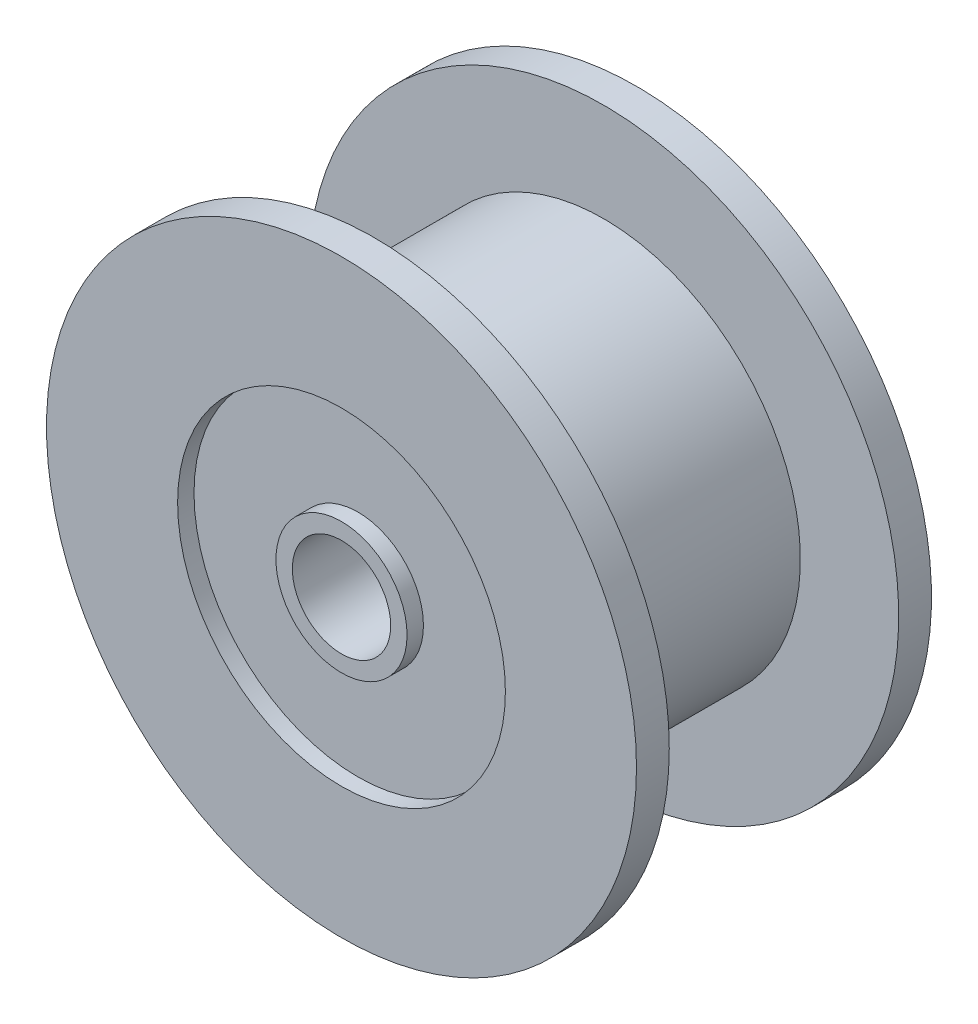
ISO-10303-21;
HEADER;
FILE_DESCRIPTION(('STEP AP214'),'2;1');
FILE_NAME('part.step','',(''),(''),'','','');
FILE_SCHEMA(('AUTOMOTIVE_DESIGN { 1 0 10303 214 1 1 1 1 }'));
ENDSEC;
DATA;
#1=APPLICATION_CONTEXT('core data for automotive mechanical design processes');
#2=APPLICATION_PROTOCOL_DEFINITION('international standard','automotive_design',2000,#1);
#3=PRODUCT_CONTEXT('',#1,'mechanical');
#4=PRODUCT('Part','Part','',(#3));
#5=PRODUCT_RELATED_PRODUCT_CATEGORY('part','',(#4));
#6=PRODUCT_DEFINITION_FORMATION('','',#4);
#7=PRODUCT_DEFINITION_CONTEXT('part definition',#1,'design');
#8=PRODUCT_DEFINITION('design','',#6,#7);
#9=PRODUCT_DEFINITION_SHAPE('','',#8);
#10=(LENGTH_UNIT() NAMED_UNIT(*) SI_UNIT(.MILLI.,.METRE.));
#11=(NAMED_UNIT(*) PLANE_ANGLE_UNIT() SI_UNIT($,.RADIAN.));
#12=(NAMED_UNIT(*) SI_UNIT($,.STERADIAN.) SOLID_ANGLE_UNIT());
#13=UNCERTAINTY_MEASURE_WITH_UNIT(LENGTH_MEASURE(1.E-05),#10,'distance_accuracy_value','');
#14=(GEOMETRIC_REPRESENTATION_CONTEXT(3) GLOBAL_UNCERTAINTY_ASSIGNED_CONTEXT((#13)) GLOBAL_UNIT_ASSIGNED_CONTEXT((#10,
#11,#12)) REPRESENTATION_CONTEXT('',''));
#15=CARTESIAN_POINT('',(0.,0.,0.));
#16=DIRECTION('',(0.,0.,1.));
#17=DIRECTION('',(1.,0.,0.));
#18=AXIS2_PLACEMENT_3D('',#15,#16,#17);
#19=CARTESIAN_POINT('',(0.,0.,8.));
#20=DIRECTION('',(0.,0.,1.));
#21=DIRECTION('',(1.,0.,0.));
#22=AXIS2_PLACEMENT_3D('',#19,#20,#21);
#23=PLANE('',#22);
#24=CARTESIAN_POINT('',(0.,0.,8.));
#25=DIRECTION('',(0.,0.,1.));
#26=DIRECTION('',(1.,0.,0.));
#27=AXIS2_PLACEMENT_3D('',#24,#25,#26);
#28=CIRCLE('',#27,1.5);
#29=CARTESIAN_POINT('',(1.5,0.,8.));
#30=VERTEX_POINT('',#29);
#31=EDGE_CURVE('E61',#30,#30,#28,.T.);
#32=ORIENTED_EDGE('',*,*,#31,.F.);
#33=EDGE_LOOP('',(#32));
#34=FACE_BOUND('',#33,.T.);
#35=CARTESIAN_POINT('',(0.,0.,8.));
#36=DIRECTION('',(0.,0.,1.));
#37=DIRECTION('',(1.,0.,0.));
#38=AXIS2_PLACEMENT_3D('',#35,#36,#37);
#39=CIRCLE('',#38,2.);
#40=CARTESIAN_POINT('',(2.,0.,8.));
#41=VERTEX_POINT('',#40);
#42=EDGE_CURVE('E83',#41,#41,#39,.T.);
#43=ORIENTED_EDGE('',*,*,#42,.T.);
#44=EDGE_LOOP('',(#43));
#45=FACE_BOUND('',#44,.T.);
#46=ADVANCED_FACE('F35',(#34,#45),#23,.T.);
#47=CARTESIAN_POINT('',(0.,0.,-1.));
#48=DIRECTION('',(0.,0.,-1.));
#49=DIRECTION('',(-1.,0.,0.));
#50=AXIS2_PLACEMENT_3D('',#47,#48,#49);
#51=PLANE('',#50);
#52=CARTESIAN_POINT('',(0.,0.,-1.));
#53=DIRECTION('',(0.,0.,-1.));
#54=DIRECTION('',(-1.,0.,0.));
#55=AXIS2_PLACEMENT_3D('',#52,#53,#54);
#56=CIRCLE('',#55,1.5);
#57=CARTESIAN_POINT('',(-1.5,0.,-1.));
#58=VERTEX_POINT('',#57);
#59=EDGE_CURVE('E39',#58,#58,#56,.T.);
#60=ORIENTED_EDGE('',*,*,#59,.F.);
#61=EDGE_LOOP('',(#60));
#62=FACE_BOUND('',#61,.T.);
#63=CARTESIAN_POINT('',(0.,0.,-1.));
#64=DIRECTION('',(0.,0.,-1.));
#65=DIRECTION('',(-1.,0.,0.));
#66=AXIS2_PLACEMENT_3D('',#63,#64,#65);
#67=CIRCLE('',#66,2.);
#68=CARTESIAN_POINT('',(-2.,0.,-1.));
#69=VERTEX_POINT('',#68);
#70=EDGE_CURVE('E71',#69,#69,#67,.T.);
#71=ORIENTED_EDGE('',*,*,#70,.T.);
#72=EDGE_LOOP('',(#71));
#73=FACE_BOUND('',#72,.T.);
#74=ADVANCED_FACE('F123',(#62,#73),#51,.T.);
#75=CARTESIAN_POINT('',(0.,0.,7.));
#76=DIRECTION('',(0.,0.,-1.));
#77=DIRECTION('',(-1.,0.,0.));
#78=AXIS2_PLACEMENT_3D('',#75,#76,#77);
#79=CYLINDRICAL_SURFACE('',#78,6.);
#80=CARTESIAN_POINT('',(0.,0.,7.));
#81=DIRECTION('',(0.,0.,1.));
#82=DIRECTION('',(1.,0.,0.));
#83=AXIS2_PLACEMENT_3D('',#80,#81,#82);
#84=CIRCLE('',#83,6.);
#85=CARTESIAN_POINT('',(6.,0.,7.));
#86=VERTEX_POINT('',#85);
#87=EDGE_CURVE('E10',#86,#86,#84,.T.);
#88=ORIENTED_EDGE('',*,*,#87,.F.);
#89=EDGE_LOOP('',(#88));
#90=FACE_BOUND('',#89,.T.);
#91=CARTESIAN_POINT('',(0.,0.,0.));
#92=DIRECTION('',(0.,0.,-1.));
#93=DIRECTION('',(-1.,0.,0.));
#94=AXIS2_PLACEMENT_3D('',#91,#92,#93);
#95=CIRCLE('',#94,6.);
#96=CARTESIAN_POINT('',(-6.,0.,0.));
#97=VERTEX_POINT('',#96);
#98=EDGE_CURVE('E51',#97,#97,#95,.T.);
#99=ORIENTED_EDGE('',*,*,#98,.F.);
#100=EDGE_LOOP('',(#99));
#101=FACE_BOUND('',#100,.T.);
#102=ADVANCED_FACE('F37',(#90,#101),#79,.T.);
#103=CARTESIAN_POINT('',(0.,0.,7.));
#104=DIRECTION('',(0.,0.,1.));
#105=DIRECTION('',(1.,0.,0.));
#106=AXIS2_PLACEMENT_3D('',#103,#104,#105);
#107=PLANE('',#106);
#108=CARTESIAN_POINT('',(0.,0.,7.));
#109=DIRECTION('',(0.,0.,1.));
#110=DIRECTION('',(1.,0.,0.));
#111=AXIS2_PLACEMENT_3D('',#108,#109,#110);
#112=CIRCLE('',#111,9.);
#113=CARTESIAN_POINT('',(9.,0.,7.));
#114=VERTEX_POINT('',#113);
#115=EDGE_CURVE('E47',#114,#114,#112,.T.);
#116=ORIENTED_EDGE('',*,*,#115,.F.);
#117=EDGE_LOOP('',(#116));
#118=FACE_BOUND('',#117,.T.);
#119=ORIENTED_EDGE('',*,*,#87,.T.);
#120=EDGE_LOOP('',(#119));
#121=FACE_BOUND('',#120,.T.);
#122=ADVANCED_FACE('F115',(#118,#121),#107,.F.);
#123=CARTESIAN_POINT('',(0.,0.,8.));
#124=DIRECTION('',(0.,0.,-1.));
#125=DIRECTION('',(-1.,0.,0.));
#126=AXIS2_PLACEMENT_3D('',#123,#124,#125);
#127=CYLINDRICAL_SURFACE('',#126,9.);
#128=CARTESIAN_POINT('',(0.,0.,8.));
#129=DIRECTION('',(0.,0.,1.));
#130=DIRECTION('',(1.,0.,0.));
#131=AXIS2_PLACEMENT_3D('',#128,#129,#130);
#132=CIRCLE('',#131,9.);
#133=CARTESIAN_POINT('',(9.,0.,8.));
#134=VERTEX_POINT('',#133);
#135=EDGE_CURVE('E43',#134,#134,#132,.T.);
#136=ORIENTED_EDGE('',*,*,#135,.F.);
#137=EDGE_LOOP('',(#136));
#138=FACE_BOUND('',#137,.T.);
#139=ORIENTED_EDGE('',*,*,#115,.T.);
#140=EDGE_LOOP('',(#139));
#141=FACE_BOUND('',#140,.T.);
#142=ADVANCED_FACE('F109',(#138,#141),#127,.T.);
#143=CARTESIAN_POINT('',(0.,0.,8.));
#144=DIRECTION('',(0.,0.,1.));
#145=DIRECTION('',(1.,0.,0.));
#146=AXIS2_PLACEMENT_3D('',#143,#144,#145);
#147=CIRCLE('',#146,5.);
#148=CARTESIAN_POINT('',(5.,0.,8.));
#149=VERTEX_POINT('',#148);
#150=EDGE_CURVE('E77',#149,#149,#147,.T.);
#151=ORIENTED_EDGE('',*,*,#150,.F.);
#152=EDGE_LOOP('',(#151));
#153=FACE_BOUND('',#152,.T.);
#154=ORIENTED_EDGE('',*,*,#135,.T.);
#155=EDGE_LOOP('',(#154));
#156=FACE_BOUND('',#155,.T.);
#157=ADVANCED_FACE('F105',(#153,#156),#23,.T.);
#158=CARTESIAN_POINT('',(0.,0.,0.));
#159=DIRECTION('',(0.,0.,-1.));
#160=DIRECTION('',(-1.,0.,0.));
#161=AXIS2_PLACEMENT_3D('',#158,#159,#160);
#162=PLANE('',#161);
#163=CARTESIAN_POINT('',(0.,0.,0.));
#164=DIRECTION('',(0.,0.,-1.));
#165=DIRECTION('',(-1.,0.,0.));
#166=AXIS2_PLACEMENT_3D('',#163,#164,#165);
#167=CIRCLE('',#166,9.);
#168=CARTESIAN_POINT('',(-9.,0.,0.));
#169=VERTEX_POINT('',#168);
#170=EDGE_CURVE('E56',#169,#169,#167,.T.);
#171=ORIENTED_EDGE('',*,*,#170,.F.);
#172=EDGE_LOOP('',(#171));
#173=FACE_BOUND('',#172,.T.);
#174=ORIENTED_EDGE('',*,*,#98,.T.);
#175=EDGE_LOOP('',(#174));
#176=FACE_BOUND('',#175,.T.);
#177=ADVANCED_FACE('F108',(#173,#176),#162,.F.);
#178=CARTESIAN_POINT('',(0.,0.,-1.));
#179=DIRECTION('',(0.,0.,1.));
#180=DIRECTION('',(1.,0.,0.));
#181=AXIS2_PLACEMENT_3D('',#178,#179,#180);
#182=CYLINDRICAL_SURFACE('',#181,9.);
#183=CARTESIAN_POINT('',(0.,0.,-1.));
#184=DIRECTION('',(0.,0.,-1.));
#185=DIRECTION('',(-1.,0.,0.));
#186=AXIS2_PLACEMENT_3D('',#183,#184,#185);
#187=CIRCLE('',#186,9.);
#188=CARTESIAN_POINT('',(-9.,0.,-1.));
#189=VERTEX_POINT('',#188);
#190=EDGE_CURVE('E55',#189,#189,#187,.T.);
#191=ORIENTED_EDGE('',*,*,#190,.F.);
#192=EDGE_LOOP('',(#191));
#193=FACE_BOUND('',#192,.T.);
#194=ORIENTED_EDGE('',*,*,#170,.T.);
#195=EDGE_LOOP('',(#194));
#196=FACE_BOUND('',#195,.T.);
#197=ADVANCED_FACE('F136',(#193,#196),#182,.T.);
#198=CARTESIAN_POINT('',(0.,0.,-1.));
#199=DIRECTION('',(0.,0.,-1.));
#200=DIRECTION('',(-1.,0.,0.));
#201=AXIS2_PLACEMENT_3D('',#198,#199,#200);
#202=CIRCLE('',#201,5.);
#203=CARTESIAN_POINT('',(-5.,0.,-1.));
#204=VERTEX_POINT('',#203);
#205=EDGE_CURVE('E65',#204,#204,#202,.T.);
#206=ORIENTED_EDGE('',*,*,#205,.F.);
#207=EDGE_LOOP('',(#206));
#208=FACE_BOUND('',#207,.T.);
#209=ORIENTED_EDGE('',*,*,#190,.T.);
#210=EDGE_LOOP('',(#209));
#211=FACE_BOUND('',#210,.T.);
#212=ADVANCED_FACE('F132',(#208,#211),#51,.T.);
#213=CARTESIAN_POINT('',(0.,0.,-3.));
#214=DIRECTION('',(0.,0.,1.));
#215=DIRECTION('',(1.,0.,0.));
#216=AXIS2_PLACEMENT_3D('',#213,#214,#215);
#217=CYLINDRICAL_SURFACE('',#216,1.5);
#218=ORIENTED_EDGE('',*,*,#59,.T.);
#219=EDGE_LOOP('',(#218));
#220=FACE_BOUND('',#219,.T.);
#221=ORIENTED_EDGE('',*,*,#31,.T.);
#222=EDGE_LOOP('',(#221));
#223=FACE_BOUND('',#222,.T.);
#224=ADVANCED_FACE('F144',(#220,#223),#217,.F.);
#225=CARTESIAN_POINT('',(0.,0.,-0.5));
#226=DIRECTION('',(0.,0.,-1.));
#227=DIRECTION('',(-1.,0.,0.));
#228=AXIS2_PLACEMENT_3D('',#225,#226,#227);
#229=CYLINDRICAL_SURFACE('',#228,5.);
#230=CARTESIAN_POINT('',(0.,0.,-0.5));
#231=DIRECTION('',(0.,0.,-1.));
#232=DIRECTION('',(-1.,0.,0.));
#233=AXIS2_PLACEMENT_3D('',#230,#231,#232);
#234=CIRCLE('',#233,5.);
#235=CARTESIAN_POINT('',(-5.,0.,-0.5));
#236=VERTEX_POINT('',#235);
#237=EDGE_CURVE('E64',#236,#236,#234,.T.);
#238=ORIENTED_EDGE('',*,*,#237,.F.);
#239=EDGE_LOOP('',(#238));
#240=FACE_BOUND('',#239,.T.);
#241=ORIENTED_EDGE('',*,*,#205,.T.);
#242=EDGE_LOOP('',(#241));
#243=FACE_BOUND('',#242,.T.);
#244=ADVANCED_FACE('F148',(#240,#243),#229,.F.);
#245=CARTESIAN_POINT('',(0.,0.,-0.5));
#246=DIRECTION('',(0.,0.,-1.));
#247=DIRECTION('',(-1.,0.,0.));
#248=AXIS2_PLACEMENT_3D('',#245,#246,#247);
#249=PLANE('',#248);
#250=CARTESIAN_POINT('',(0.,0.,-0.5));
#251=DIRECTION('',(0.,0.,-1.));
#252=DIRECTION('',(-1.,0.,0.));
#253=AXIS2_PLACEMENT_3D('',#250,#251,#252);
#254=CIRCLE('',#253,2.);
#255=CARTESIAN_POINT('',(-2.,0.,-0.5));
#256=VERTEX_POINT('',#255);
#257=EDGE_CURVE('E68',#256,#256,#254,.T.);
#258=ORIENTED_EDGE('',*,*,#257,.F.);
#259=EDGE_LOOP('',(#258));
#260=FACE_BOUND('',#259,.T.);
#261=ORIENTED_EDGE('',*,*,#237,.T.);
#262=EDGE_LOOP('',(#261));
#263=FACE_BOUND('',#262,.T.);
#264=ADVANCED_FACE('F152',(#260,#263),#249,.T.);
#265=CARTESIAN_POINT('',(0.,0.,-0.5));
#266=DIRECTION('',(0.,0.,-1.));
#267=DIRECTION('',(-1.,0.,0.));
#268=AXIS2_PLACEMENT_3D('',#265,#266,#267);
#269=CYLINDRICAL_SURFACE('',#268,2.);
#270=ORIENTED_EDGE('',*,*,#257,.T.);
#271=EDGE_LOOP('',(#270));
#272=FACE_BOUND('',#271,.T.);
#273=ORIENTED_EDGE('',*,*,#70,.F.);
#274=EDGE_LOOP('',(#273));
#275=FACE_BOUND('',#274,.T.);
#276=ADVANCED_FACE('F101',(#272,#275),#269,.T.);
#277=CARTESIAN_POINT('',(0.,0.,7.5));
#278=DIRECTION('',(0.,0.,1.));
#279=DIRECTION('',(1.,0.,0.));
#280=AXIS2_PLACEMENT_3D('',#277,#278,#279);
#281=CYLINDRICAL_SURFACE('',#280,5.);
#282=CARTESIAN_POINT('',(0.,0.,7.5));
#283=DIRECTION('',(0.,0.,1.));
#284=DIRECTION('',(1.,0.,0.));
#285=AXIS2_PLACEMENT_3D('',#282,#283,#284);
#286=CIRCLE('',#285,5.);
#287=CARTESIAN_POINT('',(5.,0.,7.5));
#288=VERTEX_POINT('',#287);
#289=EDGE_CURVE('E74',#288,#288,#286,.T.);
#290=ORIENTED_EDGE('',*,*,#289,.F.);
#291=EDGE_LOOP('',(#290));
#292=FACE_BOUND('',#291,.T.);
#293=ORIENTED_EDGE('',*,*,#150,.T.);
#294=EDGE_LOOP('',(#293));
#295=FACE_BOUND('',#294,.T.);
#296=ADVANCED_FACE('F95',(#292,#295),#281,.F.);
#297=CARTESIAN_POINT('',(0.,0.,7.5));
#298=DIRECTION('',(0.,0.,1.));
#299=DIRECTION('',(1.,0.,0.));
#300=AXIS2_PLACEMENT_3D('',#297,#298,#299);
#301=PLANE('',#300);
#302=CARTESIAN_POINT('',(0.,0.,7.5));
#303=DIRECTION('',(0.,0.,1.));
#304=DIRECTION('',(1.,0.,0.));
#305=AXIS2_PLACEMENT_3D('',#302,#303,#304);
#306=CIRCLE('',#305,2.);
#307=CARTESIAN_POINT('',(2.,0.,7.5));
#308=VERTEX_POINT('',#307);
#309=EDGE_CURVE('E80',#308,#308,#306,.T.);
#310=ORIENTED_EDGE('',*,*,#309,.F.);
#311=EDGE_LOOP('',(#310));
#312=FACE_BOUND('',#311,.T.);
#313=ORIENTED_EDGE('',*,*,#289,.T.);
#314=EDGE_LOOP('',(#313));
#315=FACE_BOUND('',#314,.T.);
#316=ADVANCED_FACE('F92',(#312,#315),#301,.T.);
#317=CARTESIAN_POINT('',(0.,0.,7.5));
#318=DIRECTION('',(0.,0.,1.));
#319=DIRECTION('',(1.,0.,0.));
#320=AXIS2_PLACEMENT_3D('',#317,#318,#319);
#321=CYLINDRICAL_SURFACE('',#320,2.);
#322=ORIENTED_EDGE('',*,*,#309,.T.);
#323=EDGE_LOOP('',(#322));
#324=FACE_BOUND('',#323,.T.);
#325=ORIENTED_EDGE('',*,*,#42,.F.);
#326=EDGE_LOOP('',(#325));
#327=FACE_BOUND('',#326,.T.);
#328=ADVANCED_FACE('F89',(#324,#327),#321,.T.);
#329=CLOSED_SHELL('',(#46,#74,#102,#122,#142,#157,#177,#197,#212,#224,#244,#264,#276,#296,#316,#328));
#330=MANIFOLD_SOLID_BREP('B2',#329);
#331=ADVANCED_BREP_SHAPE_REPRESENTATION('',(#18,#330),#14);
#332=SHAPE_DEFINITION_REPRESENTATION(#9,#331);
ENDSEC;
END-ISO-10303-21;
